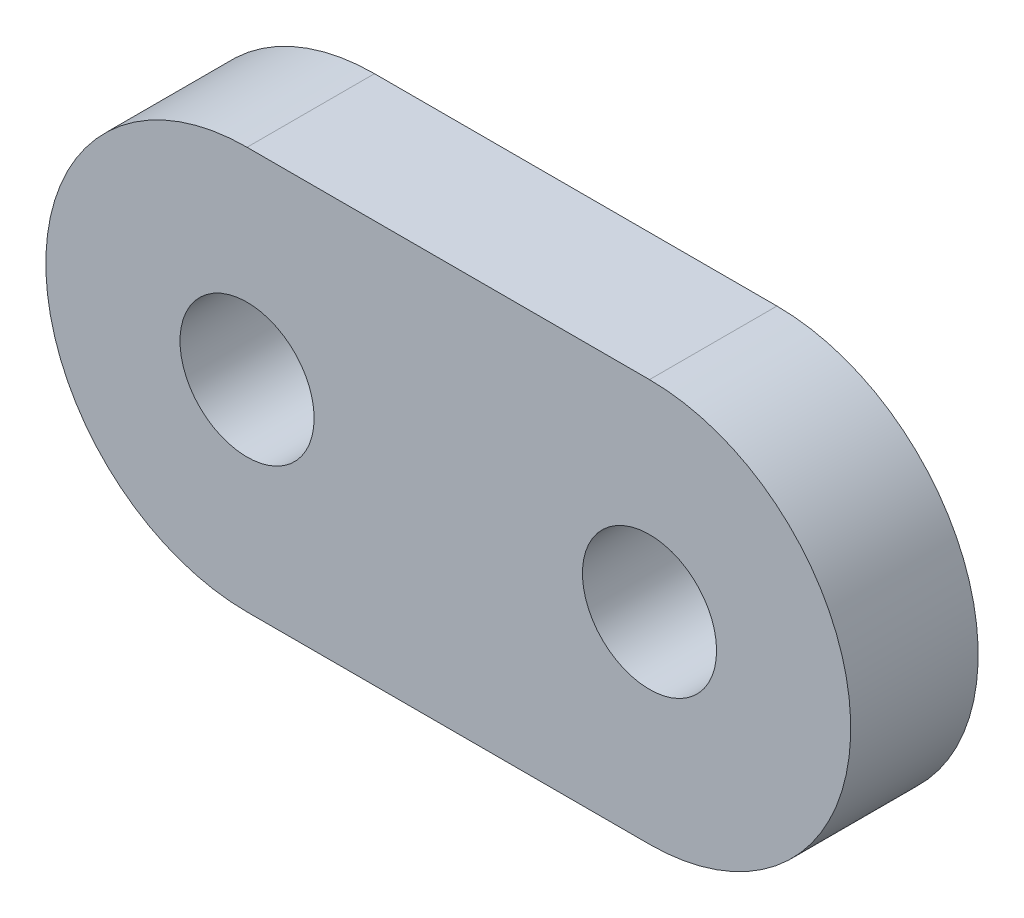
ISO-10303-21;
HEADER;
FILE_DESCRIPTION(('STEP AP214'),'2;1');
FILE_NAME('part.step','',(''),(''),'','','');
FILE_SCHEMA(('AUTOMOTIVE_DESIGN { 1 0 10303 214 1 1 1 1 }'));
ENDSEC;
DATA;
#1=APPLICATION_CONTEXT('core data for automotive mechanical design processes');
#2=APPLICATION_PROTOCOL_DEFINITION('international standard','automotive_design',2000,#1);
#3=PRODUCT_CONTEXT('',#1,'mechanical');
#4=PRODUCT('Part','Part','',(#3));
#5=PRODUCT_RELATED_PRODUCT_CATEGORY('part','',(#4));
#6=PRODUCT_DEFINITION_FORMATION('','',#4);
#7=PRODUCT_DEFINITION_CONTEXT('part definition',#1,'design');
#8=PRODUCT_DEFINITION('design','',#6,#7);
#9=PRODUCT_DEFINITION_SHAPE('','',#8);
#10=(LENGTH_UNIT() NAMED_UNIT(*) SI_UNIT(.MILLI.,.METRE.));
#11=(NAMED_UNIT(*) PLANE_ANGLE_UNIT() SI_UNIT($,.RADIAN.));
#12=(NAMED_UNIT(*) SI_UNIT($,.STERADIAN.) SOLID_ANGLE_UNIT());
#13=UNCERTAINTY_MEASURE_WITH_UNIT(LENGTH_MEASURE(1.E-05),#10,'distance_accuracy_value','');
#14=(GEOMETRIC_REPRESENTATION_CONTEXT(3) GLOBAL_UNCERTAINTY_ASSIGNED_CONTEXT((#13)) GLOBAL_UNIT_ASSIGNED_CONTEXT((#10,
#11,#12)) REPRESENTATION_CONTEXT('',''));
#15=CARTESIAN_POINT('',(0.,0.,0.));
#16=DIRECTION('',(0.,0.,1.));
#17=DIRECTION('',(1.,0.,0.));
#18=AXIS2_PLACEMENT_3D('',#15,#16,#17);
#19=CARTESIAN_POINT('',(0.,0.,1.9));
#20=DIRECTION('',(0.,0.,1.));
#21=DIRECTION('',(1.,0.,0.));
#22=AXIS2_PLACEMENT_3D('',#19,#20,#21);
#23=PLANE('',#22);
#24=CARTESIAN_POINT('',(0.,0.,1.9));
#25=DIRECTION('',(0.,0.,1.));
#26=DIRECTION('',(1.,0.,0.));
#27=AXIS2_PLACEMENT_3D('',#24,#25,#26);
#28=CIRCLE('',#27,1.);
#29=CARTESIAN_POINT('',(1.,0.,1.9));
#30=VERTEX_POINT('',#29);
#31=EDGE_CURVE('E100',#30,#30,#28,.T.);
#32=ORIENTED_EDGE('',*,*,#31,.F.);
#33=EDGE_LOOP('',(#32));
#34=FACE_BOUND('',#33,.T.);
#35=CARTESIAN_POINT('',(0.,0.,1.9));
#36=DIRECTION('',(0.,0.,1.));
#37=DIRECTION('',(1.,0.,0.));
#38=AXIS2_PLACEMENT_3D('',#35,#36,#37);
#39=CIRCLE('',#38,2.99999974966178);
#40=CARTESIAN_POINT('',(0.,2.99999949932356,1.9));
#41=VERTEX_POINT('',#40);
#42=CARTESIAN_POINT('',(0.,-3.,1.9));
#43=VERTEX_POINT('',#42);
#44=EDGE_CURVE('E85',#41,#43,#39,.T.);
#45=ORIENTED_EDGE('',*,*,#44,.T.);
#46=DIRECTION('',(1.,0.,0.));
#47=VECTOR('',#46,1.);
#48=CARTESIAN_POINT('',(0.,-3.,1.9));
#49=LINE('',#48,#47);
#50=CARTESIAN_POINT('',(5.99999999999998,-3.,1.9));
#51=VERTEX_POINT('',#50);
#52=EDGE_CURVE('E80',#43,#51,#49,.T.);
#53=ORIENTED_EDGE('',*,*,#52,.T.);
#54=CARTESIAN_POINT('',(5.99999999999998,-5.00676436074321E-07,1.9));
#55=DIRECTION('',(0.,0.,1.));
#56=DIRECTION('',(1.,0.,0.));
#57=AXIS2_PLACEMENT_3D('',#54,#55,#56);
#58=CIRCLE('',#57,2.99999974966178);
#59=CARTESIAN_POINT('',(5.99999999999998,2.99999924898535,1.9));
#60=VERTEX_POINT('',#59);
#61=EDGE_CURVE('E83',#51,#60,#58,.T.);
#62=ORIENTED_EDGE('',*,*,#61,.T.);
#63=DIRECTION('',(-1.,0.,0.));
#64=VECTOR('',#63,1.);
#65=CARTESIAN_POINT('',(0.,2.99999949932356,1.9));
#66=LINE('',#65,#64);
#67=EDGE_CURVE('E50',#60,#41,#66,.T.);
#68=ORIENTED_EDGE('',*,*,#67,.T.);
#69=EDGE_LOOP('',(#45,#53,#62,#68));
#70=FACE_BOUND('',#69,.T.);
#71=CARTESIAN_POINT('',(5.99999999999998,-5.00676436074321E-07,1.9));
#72=DIRECTION('',(0.,0.,1.));
#73=DIRECTION('',(1.,0.,0.));
#74=AXIS2_PLACEMENT_3D('',#71,#72,#73);
#75=CIRCLE('',#74,1.);
#76=CARTESIAN_POINT('',(6.99999999999998,-5.00676436074321E-07,1.9));
#77=VERTEX_POINT('',#76);
#78=EDGE_CURVE('E115',#77,#77,#75,.T.);
#79=ORIENTED_EDGE('',*,*,#78,.F.);
#80=EDGE_LOOP('',(#79));
#81=FACE_BOUND('',#80,.T.);
#82=ADVANCED_FACE('F33',(#34,#70,#81),#23,.T.);
#83=CARTESIAN_POINT('',(0.,0.,0.));
#84=DIRECTION('',(0.,0.,1.));
#85=DIRECTION('',(1.,0.,0.));
#86=AXIS2_PLACEMENT_3D('',#83,#84,#85);
#87=PLANE('',#86);
#88=CARTESIAN_POINT('',(0.,0.,0.));
#89=DIRECTION('',(0.,0.,1.));
#90=DIRECTION('',(1.,0.,0.));
#91=AXIS2_PLACEMENT_3D('',#88,#89,#90);
#92=CIRCLE('',#91,2.99999974966178);
#93=CARTESIAN_POINT('',(0.,2.99999949932356,0.));
#94=VERTEX_POINT('',#93);
#95=CARTESIAN_POINT('',(0.,-3.,0.));
#96=VERTEX_POINT('',#95);
#97=EDGE_CURVE('E97',#94,#96,#92,.T.);
#98=ORIENTED_EDGE('',*,*,#97,.F.);
#99=DIRECTION('',(-1.,0.,0.));
#100=VECTOR('',#99,1.);
#101=CARTESIAN_POINT('',(0.,2.99999949932356,0.));
#102=LINE('',#101,#100);
#103=CARTESIAN_POINT('',(5.99999999999998,2.99999924898535,0.));
#104=VERTEX_POINT('',#103);
#105=EDGE_CURVE('E73',#104,#94,#102,.T.);
#106=ORIENTED_EDGE('',*,*,#105,.F.);
#107=CARTESIAN_POINT('',(5.99999999999998,-5.00676436074321E-07,0.));
#108=DIRECTION('',(0.,0.,1.));
#109=DIRECTION('',(1.,0.,0.));
#110=AXIS2_PLACEMENT_3D('',#107,#108,#109);
#111=CIRCLE('',#110,2.99999974966178);
#112=CARTESIAN_POINT('',(5.99999999999998,-3.,0.));
#113=VERTEX_POINT('',#112);
#114=EDGE_CURVE('E67',#113,#104,#111,.T.);
#115=ORIENTED_EDGE('',*,*,#114,.F.);
#116=DIRECTION('',(1.,0.,0.));
#117=VECTOR('',#116,1.);
#118=CARTESIAN_POINT('',(0.,-3.,0.));
#119=LINE('',#118,#117);
#120=EDGE_CURVE('E89',#96,#113,#119,.T.);
#121=ORIENTED_EDGE('',*,*,#120,.F.);
#122=EDGE_LOOP('',(#98,#106,#115,#121));
#123=FACE_BOUND('',#122,.T.);
#124=CARTESIAN_POINT('',(0.,0.,0.));
#125=DIRECTION('',(0.,0.,1.));
#126=DIRECTION('',(1.,0.,0.));
#127=AXIS2_PLACEMENT_3D('',#124,#125,#126);
#128=CIRCLE('',#127,1.);
#129=CARTESIAN_POINT('',(1.,0.,0.));
#130=VERTEX_POINT('',#129);
#131=EDGE_CURVE('E112',#130,#130,#128,.T.);
#132=ORIENTED_EDGE('',*,*,#131,.T.);
#133=EDGE_LOOP('',(#132));
#134=FACE_BOUND('',#133,.T.);
#135=CARTESIAN_POINT('',(5.99999999999998,-5.00676436074321E-07,0.));
#136=DIRECTION('',(0.,0.,1.));
#137=DIRECTION('',(1.,0.,0.));
#138=AXIS2_PLACEMENT_3D('',#135,#136,#137);
#139=CIRCLE('',#138,1.);
#140=CARTESIAN_POINT('',(6.99999999999998,-5.00676436074321E-07,0.));
#141=VERTEX_POINT('',#140);
#142=EDGE_CURVE('E118',#141,#141,#139,.T.);
#143=ORIENTED_EDGE('',*,*,#142,.T.);
#144=EDGE_LOOP('',(#143));
#145=FACE_BOUND('',#144,.T.);
#146=ADVANCED_FACE('F108',(#123,#134,#145),#87,.F.);
#147=CARTESIAN_POINT('',(0.,0.,1.9));
#148=DIRECTION('',(0.,0.,-1.));
#149=DIRECTION('',(-1.,0.,0.));
#150=AXIS2_PLACEMENT_3D('',#147,#148,#149);
#151=CYLINDRICAL_SURFACE('',#150,2.99999974966178);
#152=ORIENTED_EDGE('',*,*,#97,.T.);
#153=DIRECTION('',(0.,0.,-1.));
#154=VECTOR('',#153,1.);
#155=CARTESIAN_POINT('',(0.,-3.,1.9));
#156=LINE('',#155,#154);
#157=EDGE_CURVE('E11',#43,#96,#156,.T.);
#158=ORIENTED_EDGE('',*,*,#157,.F.);
#159=ORIENTED_EDGE('',*,*,#44,.F.);
#160=DIRECTION('',(0.,0.,-1.));
#161=VECTOR('',#160,1.);
#162=CARTESIAN_POINT('',(0.,2.99999949932356,1.9));
#163=LINE('',#162,#161);
#164=EDGE_CURVE('E93',#41,#94,#163,.T.);
#165=ORIENTED_EDGE('',*,*,#164,.T.);
#166=EDGE_LOOP('',(#152,#158,#159,#165));
#167=FACE_BOUND('',#166,.T.);
#168=ADVANCED_FACE('F35',(#167),#151,.T.);
#169=CARTESIAN_POINT('',(0.,-3.,1.9));
#170=DIRECTION('',(0.,1.,0.));
#171=DIRECTION('',(0.,0.,1.));
#172=AXIS2_PLACEMENT_3D('',#169,#170,#171);
#173=PLANE('',#172);
#174=ORIENTED_EDGE('',*,*,#120,.T.);
#175=DIRECTION('',(0.,0.,-1.));
#176=VECTOR('',#175,1.);
#177=CARTESIAN_POINT('',(5.99999999999998,-3.,1.9));
#178=LINE('',#177,#176);
#179=EDGE_CURVE('E42',#51,#113,#178,.T.);
#180=ORIENTED_EDGE('',*,*,#179,.F.);
#181=ORIENTED_EDGE('',*,*,#52,.F.);
#182=ORIENTED_EDGE('',*,*,#157,.T.);
#183=EDGE_LOOP('',(#174,#180,#181,#182));
#184=FACE_BOUND('',#183,.T.);
#185=ADVANCED_FACE('F88',(#184),#173,.F.);
#186=CARTESIAN_POINT('',(5.99999999999998,-5.00676436074321E-07,1.9));
#187=DIRECTION('',(0.,0.,-1.));
#188=DIRECTION('',(-1.,0.,0.));
#189=AXIS2_PLACEMENT_3D('',#186,#187,#188);
#190=CYLINDRICAL_SURFACE('',#189,2.99999974966178);
#191=ORIENTED_EDGE('',*,*,#114,.T.);
#192=DIRECTION('',(0.,0.,-1.));
#193=VECTOR('',#192,1.);
#194=CARTESIAN_POINT('',(5.99999999999998,2.99999924898535,1.9));
#195=LINE('',#194,#193);
#196=EDGE_CURVE('E90',#60,#104,#195,.T.);
#197=ORIENTED_EDGE('',*,*,#196,.F.);
#198=ORIENTED_EDGE('',*,*,#61,.F.);
#199=ORIENTED_EDGE('',*,*,#179,.T.);
#200=EDGE_LOOP('',(#191,#197,#198,#199));
#201=FACE_BOUND('',#200,.T.);
#202=ADVANCED_FACE('F91',(#201),#190,.T.);
#203=CARTESIAN_POINT('',(0.,2.99999949932356,1.9));
#204=DIRECTION('',(0.,-1.,0.));
#205=DIRECTION('',(0.,0.,-1.));
#206=AXIS2_PLACEMENT_3D('',#203,#204,#205);
#207=PLANE('',#206);
#208=ORIENTED_EDGE('',*,*,#105,.T.);
#209=ORIENTED_EDGE('',*,*,#164,.F.);
#210=ORIENTED_EDGE('',*,*,#67,.F.);
#211=ORIENTED_EDGE('',*,*,#196,.T.);
#212=EDGE_LOOP('',(#208,#209,#210,#211));
#213=FACE_BOUND('',#212,.T.);
#214=ADVANCED_FACE('F105',(#213),#207,.F.);
#215=CARTESIAN_POINT('',(0.,0.,1.9));
#216=DIRECTION('',(0.,0.,-1.));
#217=DIRECTION('',(-1.,0.,0.));
#218=AXIS2_PLACEMENT_3D('',#215,#216,#217);
#219=CYLINDRICAL_SURFACE('',#218,1.);
#220=ORIENTED_EDGE('',*,*,#31,.T.);
#221=EDGE_LOOP('',(#220));
#222=FACE_BOUND('',#221,.T.);
#223=ORIENTED_EDGE('',*,*,#131,.F.);
#224=EDGE_LOOP('',(#223));
#225=FACE_BOUND('',#224,.T.);
#226=ADVANCED_FACE('F135',(#222,#225),#219,.F.);
#227=CARTESIAN_POINT('',(5.99999999999998,-5.00676436074321E-07,1.9));
#228=DIRECTION('',(0.,0.,-1.));
#229=DIRECTION('',(-1.,0.,0.));
#230=AXIS2_PLACEMENT_3D('',#227,#228,#229);
#231=CYLINDRICAL_SURFACE('',#230,1.);
#232=ORIENTED_EDGE('',*,*,#78,.T.);
#233=EDGE_LOOP('',(#232));
#234=FACE_BOUND('',#233,.T.);
#235=ORIENTED_EDGE('',*,*,#142,.F.);
#236=EDGE_LOOP('',(#235));
#237=FACE_BOUND('',#236,.T.);
#238=ADVANCED_FACE('F124',(#234,#237),#231,.F.);
#239=CLOSED_SHELL('',(#82,#146,#168,#185,#202,#214,#226,#238));
#240=MANIFOLD_SOLID_BREP('B2',#239);
#241=ADVANCED_BREP_SHAPE_REPRESENTATION('',(#18,#240),#14);
#242=SHAPE_DEFINITION_REPRESENTATION(#9,#241);
ENDSEC;
END-ISO-10303-21;
